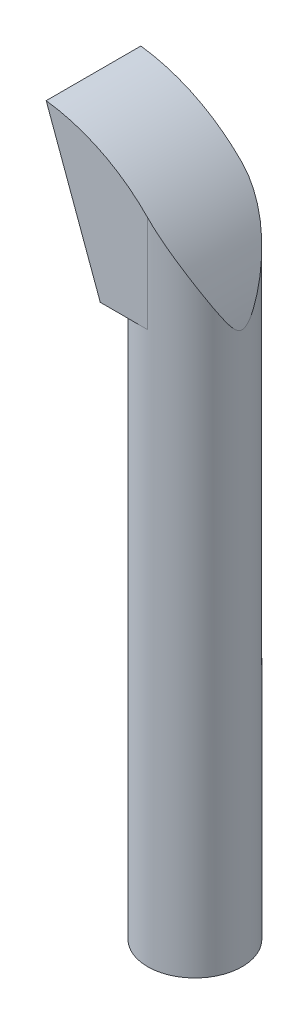
ISO-10303-21;
HEADER;
FILE_DESCRIPTION(('STEP AP214'),'2;1');
FILE_NAME('part.step','',(''),(''),'','','');
FILE_SCHEMA(('AUTOMOTIVE_DESIGN { 1 0 10303 214 1 1 1 1 }'));
ENDSEC;
DATA;
#1=APPLICATION_CONTEXT('core data for automotive mechanical design processes');
#2=APPLICATION_PROTOCOL_DEFINITION('international standard','automotive_design',2000,#1);
#3=PRODUCT_CONTEXT('',#1,'mechanical');
#4=PRODUCT('Part','Part','',(#3));
#5=PRODUCT_RELATED_PRODUCT_CATEGORY('part','',(#4));
#6=PRODUCT_DEFINITION_FORMATION('','',#4);
#7=PRODUCT_DEFINITION_CONTEXT('part definition',#1,'design');
#8=PRODUCT_DEFINITION('design','',#6,#7);
#9=PRODUCT_DEFINITION_SHAPE('','',#8);
#10=(LENGTH_UNIT() NAMED_UNIT(*) SI_UNIT(.MILLI.,.METRE.));
#11=(NAMED_UNIT(*) PLANE_ANGLE_UNIT() SI_UNIT($,.RADIAN.));
#12=(NAMED_UNIT(*) SI_UNIT($,.STERADIAN.) SOLID_ANGLE_UNIT());
#13=UNCERTAINTY_MEASURE_WITH_UNIT(LENGTH_MEASURE(1.E-05),#10,'distance_accuracy_value','');
#14=(GEOMETRIC_REPRESENTATION_CONTEXT(3) GLOBAL_UNCERTAINTY_ASSIGNED_CONTEXT((#13)) GLOBAL_UNIT_ASSIGNED_CONTEXT((#10,
#11,#12)) REPRESENTATION_CONTEXT('',''));
#15=CARTESIAN_POINT('',(0.,0.,0.));
#16=DIRECTION('',(0.,0.,1.));
#17=DIRECTION('',(1.,0.,0.));
#18=AXIS2_PLACEMENT_3D('',#15,#16,#17);
#19=CARTESIAN_POINT('',(0.,0.,0.));
#20=DIRECTION('',(0.,1.,0.));
#21=DIRECTION('',(0.,0.,1.));
#22=AXIS2_PLACEMENT_3D('',#19,#20,#21);
#23=PLANE('',#22);
#24=CARTESIAN_POINT('',(0.,0.,0.));
#25=DIRECTION('',(0.,1.,0.));
#26=DIRECTION('',(0.,0.,1.));
#27=AXIS2_PLACEMENT_3D('',#24,#25,#26);
#28=CIRCLE('',#27,13.5);
#29=CARTESIAN_POINT('',(0.,0.,13.5));
#30=VERTEX_POINT('',#29);
#31=EDGE_CURVE('E48',#30,#30,#28,.T.);
#32=ORIENTED_EDGE('',*,*,#31,.F.);
#33=EDGE_LOOP('',(#32));
#34=FACE_BOUND('',#33,.T.);
#35=CARTESIAN_POINT('',(0.,0.,0.));
#36=DIRECTION('',(0.,1.,0.));
#37=DIRECTION('',(0.,0.,1.));
#38=AXIS2_PLACEMENT_3D('',#35,#36,#37);
#39=CIRCLE('',#38,11.);
#40=CARTESIAN_POINT('',(0.,0.,-11.));
#41=VERTEX_POINT('',#40);
#42=EDGE_CURVE('E119',#41,#41,#39,.T.);
#43=ORIENTED_EDGE('',*,*,#42,.T.);
#44=EDGE_LOOP('',(#43));
#45=FACE_BOUND('',#44,.T.);
#46=ADVANCED_FACE('F39',(#34,#45),#23,.F.);
#47=CARTESIAN_POINT('',(0.,152.4,0.));
#48=DIRECTION('',(0.,-1.,0.));
#49=DIRECTION('',(0.,0.,-1.));
#50=AXIS2_PLACEMENT_3D('',#47,#48,#49);
#51=CYLINDRICAL_SURFACE('',#50,13.5);
#52=ORIENTED_EDGE('',*,*,#31,.T.);
#53=EDGE_LOOP('',(#52));
#54=FACE_BOUND('',#53,.T.);
#55=CARTESIAN_POINT('',(0.,157.4,0.));
#56=DIRECTION('',(0.,1.,0.));
#57=DIRECTION('',(0.,0.,1.));
#58=AXIS2_PLACEMENT_3D('',#55,#56,#57);
#59=CIRCLE('',#58,13.5);
#60=CARTESIAN_POINT('',(0.,157.4,-13.5));
#61=VERTEX_POINT('',#60);
#62=CARTESIAN_POINT('',(-13.5,157.4,0.));
#63=VERTEX_POINT('',#62);
#64=EDGE_CURVE('E63',#61,#63,#59,.T.);
#65=ORIENTED_EDGE('',*,*,#64,.F.);
#66=DIRECTION('',(0.,-1.,0.));
#67=VECTOR('',#66,1.);
#68=CARTESIAN_POINT('',(0.,217.4,-13.5));
#69=LINE('',#68,#67);
#70=CARTESIAN_POINT('',(0.,185.108601855479,-13.5));
#71=VERTEX_POINT('',#70);
#72=EDGE_CURVE('E95',#71,#61,#69,.T.);
#73=ORIENTED_EDGE('',*,*,#72,.F.);
#74=CARTESIAN_POINT('',(0.,185.108601855479,-13.5));
#75=CARTESIAN_POINT('',(0.276417729223496,184.825200464528,-13.4999874540833));
#76=CARTESIAN_POINT('',(0.549352264094859,184.538478835733,-13.4915111923814));
#77=CARTESIAN_POINT('',(1.08770281828671,183.959082046283,-13.4588144201994));
#78=CARTESIAN_POINT('',(1.35312096432126,183.666408610748,-13.4345984105803));
#79=CARTESIAN_POINT('',(1.87557894455088,183.076159175742,-13.3716601343393));
#80=CARTESIAN_POINT('',(2.13263287467226,182.778592848925,-13.3329638116838));
#81=CARTESIAN_POINT('',(2.63854171365322,182.178576756648,-13.242135304767));
#82=CARTESIAN_POINT('',(2.88739597207784,181.876126606604,-13.1900020575083));
#83=CARTESIAN_POINT('',(3.6184040311439,180.965762445603,-13.0156539803712));
#84=CARTESIAN_POINT('',(4.08814043978334,180.351284754969,-12.8750880713242));
#85=CARTESIAN_POINT('',(4.99333078728589,179.107973803266,-12.5518047882512));
#86=CARTESIAN_POINT('',(5.42876354172443,178.47913197596,-12.3690616369186));
#87=CARTESIAN_POINT('',(6.15649806339511,177.3745251173,-12.0193821453888));
#88=CARTESIAN_POINT('',(6.45665814820546,176.901303538056,-11.8606136327867));
#89=CARTESIAN_POINT('',(7.03797219099421,175.949499432191,-11.5251716226349));
#90=CARTESIAN_POINT('',(7.31912428724114,175.47091638578,-11.3484963754388));
#91=CARTESIAN_POINT('',(7.86261030708216,174.50913963669,-10.9789516363458));
#92=CARTESIAN_POINT('',(8.12493812723558,174.025944495641,-10.7860769356621));
#93=CARTESIAN_POINT('',(8.630871030605,173.05587993648,-10.3856697912069));
#94=CARTESIAN_POINT('',(8.87447674153205,172.569010642155,-10.1781378393087));
#95=CARTESIAN_POINT('',(9.34378895441439,171.591099882642,-9.74909969312273));
#96=CARTESIAN_POINT('',(9.56944944057314,171.100051053208,-9.52756003276628));
#97=CARTESIAN_POINT('',(10.0024467436137,170.115701534132,-9.07192597522746));
#98=CARTESIAN_POINT('',(10.2097832150864,169.622400802224,-8.83783134151644));
#99=CARTESIAN_POINT('',(10.6062785372473,168.634561257055,-8.35785338281578));
#100=CARTESIAN_POINT('',(10.7954457415881,168.140023121065,-8.11197555406515));
#101=CARTESIAN_POINT('',(11.1559246591999,167.150398740358,-7.60862677364718));
#102=CARTESIAN_POINT('',(11.3272381613693,166.655312555586,-7.35115698717549));
#103=CARTESIAN_POINT('',(11.5944505756655,165.84161207909,-6.91798189069923));
#104=CARTESIAN_POINT('',(11.6955088233446,165.522830796972,-6.74574820434478));
#105=CARTESIAN_POINT('',(11.8903311771734,164.885922515164,-6.39609913487368));
#106=CARTESIAN_POINT('',(11.9840960568596,164.56779544958,-6.21868430402344));
#107=CARTESIAN_POINT('',(12.1641953970957,163.933303667212,-5.85856786462792));
#108=CARTESIAN_POINT('',(12.2505441084519,163.616936714898,-5.67587733987633));
#109=CARTESIAN_POINT('',(12.416023847263,162.986076974348,-5.30412381388486));
#110=CARTESIAN_POINT('',(12.4951550467826,162.671584141602,-5.11506096470783));
#111=CARTESIAN_POINT('',(12.6601838655678,161.987453777095,-4.69363163997697));
#112=CARTESIAN_POINT('',(12.74461819976,161.618396513834,-4.45973273681962));
#113=CARTESIAN_POINT('',(12.8636052157694,161.069818862742,-4.09801639676722));
#114=CARTESIAN_POINT('',(12.9020226892122,160.887625180864,-3.97551247724385));
#115=CARTESIAN_POINT('',(12.9762255195434,160.525675059018,-3.72619315579418));
#116=CARTESIAN_POINT('',(13.0120110889909,160.345918423187,-3.59937810325804));
#117=CARTESIAN_POINT('',(13.0772573239183,160.008498543901,-3.35405801132094));
#118=CARTESIAN_POINT('',(13.1069871943085,159.850502204315,-3.23608427470228));
#119=CARTESIAN_POINT('',(13.1642013302439,159.538193632264,-2.99485895594703));
#120=CARTESIAN_POINT('',(13.1916859961838,159.383880746406,-2.87160832085875));
#121=CARTESIAN_POINT('',(13.2442124260753,159.080829101054,-2.61868080237641));
#122=CARTESIAN_POINT('',(13.2692602810889,158.932077047039,-2.48902123113103));
#123=CARTESIAN_POINT('',(13.3167478644149,158.642271831714,-2.22098628825693));
#124=CARTESIAN_POINT('',(13.3391895364893,158.501212974799,-2.08261753250071));
#125=CARTESIAN_POINT('',(13.3764783413741,158.260573695592,-1.82559348124679));
#126=CARTESIAN_POINT('',(13.3919137331254,158.158662258806,-1.70923188925226));
#127=CARTESIAN_POINT('',(13.4206029782037,157.965523261181,-1.46707851776203));
#128=CARTESIAN_POINT('',(13.4338517852849,157.874320550239,-1.34126587356081));
#129=CARTESIAN_POINT('',(13.45769811964,157.707383639071,-1.07628448642065));
#130=CARTESIAN_POINT('',(13.4682488206191,157.631926347695,-0.936931195152893));
#131=CARTESIAN_POINT('',(13.4852866093952,157.508666376205,-0.646398092423472));
#132=CARTESIAN_POINT('',(13.4917967767799,157.46070675123,-0.495291104258699));
#133=CARTESIAN_POINT('',(13.4983135848428,157.412541577951,-0.237198497261295));
#134=CARTESIAN_POINT('',(13.4997625908487,157.401762352363,-0.132240118327899));
#135=CARTESIAN_POINT('',(13.5001829314759,157.398642262197,0.0780019106798999));
#136=CARTESIAN_POINT('',(13.4991538946939,157.406304161531,0.183285607150218));
#137=CARTESIAN_POINT('',(13.4947493622111,157.438898599936,0.390462456858462));
#138=CARTESIAN_POINT('',(13.4913852489761,157.463747358593,0.492369555500216));
#139=CARTESIAN_POINT('',(13.4826493348881,157.5276798372,0.691462486205586));
#140=CARTESIAN_POINT('',(13.4772758740252,157.566775326314,0.788644339314415));
#141=CARTESIAN_POINT('',(13.4596314509396,157.693634540215,1.05785486552315));
#142=CARTESIAN_POINT('',(13.4453758171899,157.794552560335,1.22345628763196));
#143=CARTESIAN_POINT('',(13.4129241388463,158.017974782822,1.53910137302169));
#144=CARTESIAN_POINT('',(13.3947099397197,158.140577937209,1.68906848367988));
#145=CARTESIAN_POINT('',(13.3580556980028,158.380287367906,1.95647479506771));
#146=CARTESIAN_POINT('',(13.3400146374696,158.495703979723,2.07550969050095));
#147=CARTESIAN_POINT('',(13.3019956575804,158.733026276211,2.30664588852181));
#148=CARTESIAN_POINT('',(13.2820166842118,158.854935475701,2.41874336300704));
#149=CARTESIAN_POINT('',(13.2193819084275,159.227869974431,2.74735806747325));
#150=CARTESIAN_POINT('',(13.1741005444134,159.485622512124,2.95569696637194));
#151=CARTESIAN_POINT('',(13.0770371455161,160.012173937718,3.35918770786828));
#152=CARTESIAN_POINT('',(13.0252196253609,160.281027283475,3.55425786840573));
#153=CARTESIAN_POINT('',(12.9156440326805,160.82434209555,3.93383887238316));
#154=CARTESIAN_POINT('',(12.8578938132499,161.0987957725,4.11836318407754));
#155=CARTESIAN_POINT('',(12.7411208210895,161.630632004565,4.46596342451232));
#156=CARTESIAN_POINT('',(12.6825231076243,161.887739484957,4.62960700568554));
#157=CARTESIAN_POINT('',(12.5603712562729,162.404194305576,4.95143073339791));
#158=CARTESIAN_POINT('',(12.4968168644429,162.663541759956,5.1096105994166));
#159=CARTESIAN_POINT('',(12.2987178745775,163.443988119298,5.57731361220895));
#160=CARTESIAN_POINT('',(12.1567637492248,163.967370669968,5.87992288302149));
#161=CARTESIAN_POINT('',(11.8528451685087,165.017567493981,6.47073212793354));
#162=CARTESIAN_POINT('',(11.6908490699721,165.544385917326,6.75890828030434));
#163=CARTESIAN_POINT('',(11.3468680557062,166.598642105569,7.32170213578978));
#164=CARTESIAN_POINT('',(11.1648859176778,167.126079774349,7.59632171535425));
#165=CARTESIAN_POINT('',(10.7810119681292,168.179361941639,8.13191933189881));
#166=CARTESIAN_POINT('',(10.5791553372729,168.705207615551,8.39292026561207));
#167=CARTESIAN_POINT('',(10.1549827951891,169.755201736088,8.9014578939264));
#168=CARTESIAN_POINT('',(9.93266582126274,170.27935009309,9.14899388810237));
#169=CARTESIAN_POINT('',(9.4675045768962,171.324513786799,9.62954142854183));
#170=CARTESIAN_POINT('',(9.2246799425551,171.845531620146,9.8625665057026));
#171=CARTESIAN_POINT('',(8.71806272600314,172.883996485662,10.3131115630462));
#172=CARTESIAN_POINT('',(8.45427176858849,173.40144379116,10.5306327422386));
#173=CARTESIAN_POINT('',(7.77829912747694,174.670608089044,11.0454937262888));
#174=CARTESIAN_POINT('',(7.35396459089784,175.419858474508,11.3331553820815));
#175=CARTESIAN_POINT('',(6.45896470600687,176.906099630235,11.866046850797));
#176=CARTESIAN_POINT('',(5.98828658892834,177.643086955979,12.11126491788));
#177=CARTESIAN_POINT('',(5.00263321168015,179.097889708668,12.5504399504745));
#178=CARTESIAN_POINT('',(4.48785578502941,179.815773589625,12.7446114345513));
#179=CARTESIAN_POINT('',(3.41334914813078,181.230779230251,13.0734241407379));
#180=CARTESIAN_POINT('',(2.85365616870878,181.927917114436,13.2081127850884));
#181=CARTESIAN_POINT('',(1.91005475213496,183.039000448024,13.3692514818258));
#182=CARTESIAN_POINT('',(1.53914934425231,183.460896341437,13.4173566743529));
#183=CARTESIAN_POINT('',(0.970867971933179,184.085268255382,13.4663894322316));
#184=CARTESIAN_POINT('',(0.779290678314137,184.292147380875,13.4788802471627));
#185=CARTESIAN_POINT('',(0.392397634798731,184.702780676214,13.4956845591754));
#186=CARTESIAN_POINT('',(0.197081257882159,184.906534311431,13.4999966723908));
#187=CARTESIAN_POINT('',(0.,185.10860185548,13.5));
#188=B_SPLINE_CURVE_WITH_KNOTS('',3,(#74,#75,#76,#77,#78,#79,#80,#81,#82,#83,#84,#85,#86,#87,
#88,#89,#90,#91,#92,#93,#94,#95,#96,#97,#98,#99,#100,#101,#102,#103,#104,#105,#106,#107,#108,
#109,#110,#111,#112,#113,#114,#115,#116,#117,#118,#119,#120,#121,#122,#123,#124,#125,#126,#127,
#128,#129,#130,#131,#132,#133,#134,#135,#136,#137,#138,#139,#140,#141,#142,#143,#144,#145,#146,
#147,#148,#149,#150,#151,#152,#153,#154,#155,#156,#157,#158,#159,#160,#161,#162,#163,#164,#165,
#166,#167,#168,#169,#170,#171,#172,#173,#174,#175,#176,#177,#178,#179,#180,#181,#182,#183,#184,
#185,#186,#187),.UNSPECIFIED.,.F.,.F.,(4,2,2,2,2,2,2,2,2,2,2,2,2,2,2,2,2,2,2,2,2,2,2,2,2,2,2,2,
2,2,2,2,2,2,2,2,2,2,2,2,2,2,2,2,2,2,2,2,2,2,2,2,2,2,2,2,4),(0.,1.18744742959942,
2.37455545187497,3.55954667138747,4.74463166455517,7.10057947758689,9.45797099718127,
11.2047025057698,12.9516048503151,14.699071061704,16.4464786588223,18.1982314845426,
19.9500173239031,21.7009938531564,23.4517947697121,24.5801894336105,25.7084642560095,
26.8345200883272,27.9605490685626,29.29523354798,29.9638359819648,30.6323843585124,
31.2305269439579,31.8285626267109,32.4250628290408,33.0211152486141,33.487002512356,
33.9539503643737,34.4285231494082,34.9003595994631,35.2153793240414,35.5304462659884,
35.8439880835303,36.1577895060146,36.7377415938867,37.3204117639938,37.8203815061065,
38.3206247182756,39.3231938426294,40.3314613023507,41.3384109108168,42.2693569066625,
43.2003506287117,45.0627739376912,46.9281761761601,48.7933194844948,50.6552186362249,
52.5172145485988,54.377447384311,56.2375362006,58.9589130559685,61.6810418252708,
64.3915413080531,67.0998759475474,68.7901988109339,69.6367579951445,70.4834604074913),.UNSPECIFIED.);
#189=CARTESIAN_POINT('',(0.,185.10860185548,13.5));
#190=VERTEX_POINT('',#189);
#191=EDGE_CURVE('E92',#71,#190,#188,.T.);
#192=ORIENTED_EDGE('',*,*,#191,.T.);
#193=DIRECTION('',(0.,-1.,0.));
#194=VECTOR('',#193,1.);
#195=CARTESIAN_POINT('',(0.,217.4,13.5));
#196=LINE('',#195,#194);
#197=CARTESIAN_POINT('',(0.,157.4,13.5));
#198=VERTEX_POINT('',#197);
#199=EDGE_CURVE('E86',#190,#198,#196,.T.);
#200=ORIENTED_EDGE('',*,*,#199,.T.);
#201=EDGE_CURVE('E88',#63,#198,#59,.T.);
#202=ORIENTED_EDGE('',*,*,#201,.F.);
#203=EDGE_LOOP('',(#65,#73,#192,#200,#202));
#204=FACE_BOUND('',#203,.T.);
#205=ADVANCED_FACE('F41',(#54,#204),#51,.T.);
#206=CARTESIAN_POINT('',(0.,152.4,0.));
#207=DIRECTION('',(0.,-1.,0.));
#208=DIRECTION('',(0.,0.,-1.));
#209=AXIS2_PLACEMENT_3D('',#206,#207,#208);
#210=CYLINDRICAL_SURFACE('',#209,11.);
#211=CARTESIAN_POINT('',(0.,152.4,0.));
#212=DIRECTION('',(0.,1.,0.));
#213=DIRECTION('',(0.,0.,1.));
#214=AXIS2_PLACEMENT_3D('',#211,#212,#213);
#215=CIRCLE('',#214,11.);
#216=CARTESIAN_POINT('',(0.,152.4,-11.));
#217=VERTEX_POINT('',#216);
#218=EDGE_CURVE('E111',#217,#217,#215,.T.);
#219=CARTESIAN_POINT('',(0.,152.4,-11.));
#220=CARTESIAN_POINT('',(0.,150.8125,-11.));
#221=CARTESIAN_POINT('',(0.,149.225,-11.));
#222=CARTESIAN_POINT('',(0.,146.05,-11.));
#223=CARTESIAN_POINT('',(0.,144.4625,-11.));
#224=CARTESIAN_POINT('',(0.,141.2875,-11.));
#225=CARTESIAN_POINT('',(0.,139.7,-11.));
#226=CARTESIAN_POINT('',(0.,136.525,-11.));
#227=CARTESIAN_POINT('',(0.,134.9375,-11.));
#228=CARTESIAN_POINT('',(0.,131.7625,-11.));
#229=CARTESIAN_POINT('',(0.,130.175,-11.));
#230=CARTESIAN_POINT('',(0.,127.,-11.));
#231=CARTESIAN_POINT('',(0.,125.4125,-11.));
#232=CARTESIAN_POINT('',(0.,122.2375,-11.));
#233=CARTESIAN_POINT('',(0.,120.65,-11.));
#234=CARTESIAN_POINT('',(0.,117.475,-11.));
#235=CARTESIAN_POINT('',(0.,115.8875,-11.));
#236=CARTESIAN_POINT('',(0.,112.7125,-11.));
#237=CARTESIAN_POINT('',(0.,111.125,-11.));
#238=CARTESIAN_POINT('',(0.,107.95,-11.));
#239=CARTESIAN_POINT('',(0.,106.3625,-11.));
#240=CARTESIAN_POINT('',(0.,103.1875,-11.));
#241=CARTESIAN_POINT('',(0.,101.6,-11.));
#242=CARTESIAN_POINT('',(0.,98.425,-11.));
#243=CARTESIAN_POINT('',(0.,96.8375,-11.));
#244=CARTESIAN_POINT('',(0.,93.6625,-11.));
#245=CARTESIAN_POINT('',(0.,92.075,-11.));
#246=CARTESIAN_POINT('',(0.,88.9,-11.));
#247=CARTESIAN_POINT('',(0.,87.3125,-11.));
#248=CARTESIAN_POINT('',(0.,84.1375,-11.));
#249=CARTESIAN_POINT('',(0.,82.55,-11.));
#250=CARTESIAN_POINT('',(0.,79.375,-11.));
#251=CARTESIAN_POINT('',(0.,77.7875,-11.));
#252=CARTESIAN_POINT('',(0.,74.6125,-11.));
#253=CARTESIAN_POINT('',(0.,73.025,-11.));
#254=CARTESIAN_POINT('',(0.,69.85,-11.));
#255=CARTESIAN_POINT('',(0.,68.2625,-11.));
#256=CARTESIAN_POINT('',(0.,65.0875,-11.));
#257=CARTESIAN_POINT('',(0.,63.5,-11.));
#258=CARTESIAN_POINT('',(0.,60.325,-11.));
#259=CARTESIAN_POINT('',(0.,58.7375,-11.));
#260=CARTESIAN_POINT('',(0.,55.5625,-11.));
#261=CARTESIAN_POINT('',(0.,53.975,-11.));
#262=CARTESIAN_POINT('',(0.,50.8,-11.));
#263=CARTESIAN_POINT('',(0.,49.2125,-11.));
#264=CARTESIAN_POINT('',(0.,46.0375,-11.));
#265=CARTESIAN_POINT('',(0.,44.45,-11.));
#266=CARTESIAN_POINT('',(0.,41.275,-11.));
#267=CARTESIAN_POINT('',(0.,39.6875,-11.));
#268=CARTESIAN_POINT('',(0.,36.5125,-11.));
#269=CARTESIAN_POINT('',(0.,34.925,-11.));
#270=CARTESIAN_POINT('',(0.,31.75,-11.));
#271=CARTESIAN_POINT('',(0.,30.1625,-11.));
#272=CARTESIAN_POINT('',(0.,26.9875,-11.));
#273=CARTESIAN_POINT('',(0.,25.4,-11.));
#274=CARTESIAN_POINT('',(0.,22.225,-11.));
#275=CARTESIAN_POINT('',(0.,20.6375,-11.));
#276=CARTESIAN_POINT('',(0.,17.4625,-11.));
#277=CARTESIAN_POINT('',(0.,15.875,-11.));
#278=CARTESIAN_POINT('',(0.,12.7,-11.));
#279=CARTESIAN_POINT('',(0.,11.1125,-11.));
#280=CARTESIAN_POINT('',(0.,7.93750000000001,-11.));
#281=CARTESIAN_POINT('',(0.,6.35,-11.));
#282=CARTESIAN_POINT('',(0.,3.175,-11.));
#283=CARTESIAN_POINT('',(0.,1.5875,-11.));
#284=CARTESIAN_POINT('',(0.,0.,-11.));
#285=B_SPLINE_CURVE_WITH_KNOTS('',3,(#219,#220,#221,#222,#223,#224,#225,#226,#227,#228,#229,
#230,#231,#232,#233,#234,#235,#236,#237,#238,#239,#240,#241,#242,#243,#244,#245,#246,#247,#248,
#249,#250,#251,#252,#253,#254,#255,#256,#257,#258,#259,#260,#261,#262,#263,#264,#265,#266,#267,
#268,#269,#270,#271,#272,#273,#274,#275,#276,#277,#278,#279,#280,#281,#282,#283,#284),
.UNSPECIFIED.,.F.,.F.,(4,2,2,2,2,2,2,2,2,2,2,2,2,2,2,2,2,2,2,2,2,2,2,2,2,2,2,2,2,2,2,2,4),(0.,
4.76249999999998,9.52499999999998,14.2875,19.05,23.8125,28.575,33.3375,38.1,42.8625,47.625,
52.3875,57.15,61.9125,66.675,71.4375,76.2,80.9625,85.725,90.4875,95.25,100.0125,104.775,
109.5375,114.3,119.0625,123.825,128.5875,133.35,138.1125,142.875,147.6375,152.4),.UNSPECIFIED.);
#286=EDGE_CURVE('BSEAM131',#217,#41,#285,.T.);
#287=ORIENTED_EDGE('',*,*,#218,.T.);
#288=ORIENTED_EDGE('',*,*,#42,.F.);
#289=ORIENTED_EDGE('',*,*,#286,.T.);
#290=ORIENTED_EDGE('',*,*,#286,.F.);
#291=EDGE_LOOP('',(#287,#289,#288,#290));
#292=FACE_BOUND('',#291,.T.);
#293=ADVANCED_FACE('F131',(#292),#210,.F.);
#294=CARTESIAN_POINT('',(0.,152.4,0.));
#295=DIRECTION('',(0.,1.,0.));
#296=DIRECTION('',(0.,0.,1.));
#297=AXIS2_PLACEMENT_3D('',#294,#295,#296);
#298=PLANE('',#297);
#299=ORIENTED_EDGE('',*,*,#218,.F.);
#300=EDGE_LOOP('',(#299));
#301=FACE_BOUND('',#300,.T.);
#302=ADVANCED_FACE('F133',(#301),#298,.F.);
#303=CARTESIAN_POINT('',(-11.0231067027083,157.4,-15.));
#304=DIRECTION('',(0.,-1.,0.));
#305=DIRECTION('',(0.,0.,-1.));
#306=AXIS2_PLACEMENT_3D('',#303,#304,#305);
#307=PLANE('',#306);
#308=DIRECTION('',(-1.,0.,0.));
#309=VECTOR('',#308,1.);
#310=CARTESIAN_POINT('',(-41.1135010840058,157.4,-13.5));
#311=LINE('',#310,#309);
#312=CARTESIAN_POINT('',(-13.5,157.4,-13.5));
#313=VERTEX_POINT('',#312);
#314=EDGE_CURVE('E96',#61,#313,#311,.T.);
#315=ORIENTED_EDGE('',*,*,#314,.F.);
#316=ORIENTED_EDGE('',*,*,#64,.T.);
#317=DIRECTION('',(0.,0.,1.));
#318=VECTOR('',#317,1.);
#319=CARTESIAN_POINT('',(-13.5,157.4,-15.));
#320=LINE('',#319,#318);
#321=EDGE_CURVE('E107',#313,#63,#320,.T.);
#322=ORIENTED_EDGE('',*,*,#321,.F.);
#323=EDGE_LOOP('',(#315,#316,#322));
#324=FACE_BOUND('',#323,.T.);
#325=ADVANCED_FACE('F140',(#324),#307,.T.);
#326=CARTESIAN_POINT('',(-13.5,157.4,-15.));
#327=DIRECTION('',(-0.939007572240501,-0.343896465923975,0.));
#328=DIRECTION('',(0.343896465923975,-0.939007572240501,0.));
#329=AXIS2_PLACEMENT_3D('',#326,#327,#328);
#330=PLANE('',#329);
#331=DIRECTION('',(-0.343896465923975,0.939007572240501,0.));
#332=VECTOR('',#331,1.);
#333=CARTESIAN_POINT('',(-13.5,157.4,-13.5));
#334=LINE('',#333,#332);
#335=CARTESIAN_POINT('',(-28.9264280837807,199.521784370113,-13.5));
#336=VERTEX_POINT('',#335);
#337=EDGE_CURVE('E162',#313,#336,#334,.T.);
#338=ORIENTED_EDGE('',*,*,#337,.F.);
#339=ORIENTED_EDGE('',*,*,#321,.T.);
#340=CARTESIAN_POINT('',(-13.5,157.4,13.5));
#341=VERTEX_POINT('',#340);
#342=EDGE_CURVE('E105',#63,#341,#320,.T.);
#343=ORIENTED_EDGE('',*,*,#342,.T.);
#344=DIRECTION('',(0.343896465923975,-0.939007572240501,0.));
#345=VECTOR('',#344,1.);
#346=CARTESIAN_POINT('',(-13.5,157.4,13.4999999999999));
#347=LINE('',#346,#345);
#348=CARTESIAN_POINT('',(-28.9264280837807,199.521784370113,13.4999999999999));
#349=VERTEX_POINT('',#348);
#350=EDGE_CURVE('E55',#349,#341,#347,.T.);
#351=ORIENTED_EDGE('',*,*,#350,.F.);
#352=DIRECTION('',(0.,0.,1.));
#353=VECTOR('',#352,1.);
#354=CARTESIAN_POINT('',(-28.9264280837807,199.521784370113,-15.));
#355=LINE('',#354,#353);
#356=EDGE_CURVE('E115',#336,#349,#355,.T.);
#357=ORIENTED_EDGE('',*,*,#356,.F.);
#358=EDGE_LOOP('',(#338,#339,#343,#351,#357));
#359=FACE_BOUND('',#358,.T.);
#360=ADVANCED_FACE('F150',(#359),#330,.T.);
#361=CARTESIAN_POINT('',(-35.1223247922395,150.853546402356,-15.));
#362=DIRECTION('',(0.,0.,1.));
#363=DIRECTION('',(1.,0.,0.));
#364=AXIS2_PLACEMENT_3D('',#361,#362,#363);
#365=CYLINDRICAL_SURFACE('',#364,49.0610489381152);
#366=CARTESIAN_POINT('',(-35.1223247922395,150.853546402356,-13.5));
#367=DIRECTION('',(0.,0.,1.));
#368=DIRECTION('',(1.,0.,0.));
#369=AXIS2_PLACEMENT_3D('',#366,#367,#368);
#370=CIRCLE('',#369,49.0610489381152);
#371=EDGE_CURVE('E11',#336,#71,#370,.F.);
#372=ORIENTED_EDGE('',*,*,#371,.F.);
#373=ORIENTED_EDGE('',*,*,#356,.T.);
#374=CARTESIAN_POINT('',(-35.1223247922395,150.853546402356,13.4999999999999));
#375=DIRECTION('',(0.,0.,-1.));
#376=DIRECTION('',(-1.,0.,0.));
#377=AXIS2_PLACEMENT_3D('',#374,#375,#376);
#378=CIRCLE('',#377,49.0610489381152);
#379=EDGE_CURVE('E185',#190,#349,#378,.F.);
#380=ORIENTED_EDGE('',*,*,#379,.F.);
#381=ORIENTED_EDGE('',*,*,#191,.F.);
#382=EDGE_LOOP('',(#372,#373,#380,#381));
#383=FACE_BOUND('',#382,.T.);
#384=ADVANCED_FACE('F146',(#383),#365,.T.);
#385=DIRECTION('',(1.,0.,0.));
#386=VECTOR('',#385,1.);
#387=CARTESIAN_POINT('',(0.,157.4,13.5));
#388=LINE('',#387,#386);
#389=EDGE_CURVE('E98',#341,#198,#388,.T.);
#390=ORIENTED_EDGE('',*,*,#389,.F.);
#391=ORIENTED_EDGE('',*,*,#342,.F.);
#392=ORIENTED_EDGE('',*,*,#201,.T.);
#393=EDGE_LOOP('',(#390,#391,#392));
#394=FACE_BOUND('',#393,.T.);
#395=ADVANCED_FACE('F104',(#394),#307,.T.);
#396=CARTESIAN_POINT('',(0.,217.4,13.5));
#397=DIRECTION('',(0.,0.,-1.));
#398=DIRECTION('',(-1.,0.,0.));
#399=AXIS2_PLACEMENT_3D('',#396,#397,#398);
#400=PLANE('',#399);
#401=ORIENTED_EDGE('',*,*,#350,.T.);
#402=ORIENTED_EDGE('',*,*,#389,.T.);
#403=ORIENTED_EDGE('',*,*,#199,.F.);
#404=ORIENTED_EDGE('',*,*,#379,.T.);
#405=EDGE_LOOP('',(#401,#402,#403,#404));
#406=FACE_BOUND('',#405,.T.);
#407=ADVANCED_FACE('F99',(#406),#400,.F.);
#408=CARTESIAN_POINT('',(-41.1135010840058,217.4,-13.5));
#409=DIRECTION('',(0.,0.,1.));
#410=DIRECTION('',(1.,0.,0.));
#411=AXIS2_PLACEMENT_3D('',#408,#409,#410);
#412=PLANE('',#411);
#413=ORIENTED_EDGE('',*,*,#337,.T.);
#414=ORIENTED_EDGE('',*,*,#371,.T.);
#415=ORIENTED_EDGE('',*,*,#72,.T.);
#416=ORIENTED_EDGE('',*,*,#314,.T.);
#417=EDGE_LOOP('',(#413,#414,#415,#416));
#418=FACE_BOUND('',#417,.T.);
#419=ADVANCED_FACE('F166',(#418),#412,.F.);
#420=CLOSED_SHELL('',(#46,#205,#293,#302,#325,#360,#384,#395,#407,#419));
#421=MANIFOLD_SOLID_BREP('B2',#420);
#422=ADVANCED_BREP_SHAPE_REPRESENTATION('',(#18,#421),#14);
#423=SHAPE_DEFINITION_REPRESENTATION(#9,#422);
ENDSEC;
END-ISO-10303-21;
